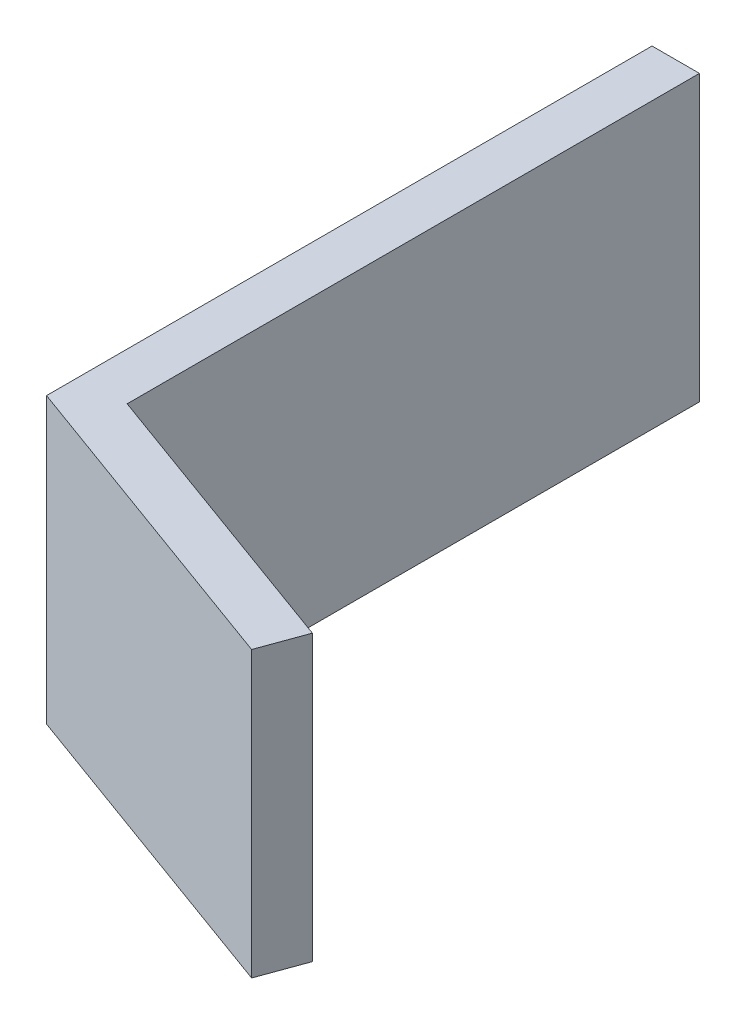
ISO-10303-21;
HEADER;
FILE_DESCRIPTION(('STEP AP214'),'2;1');
FILE_NAME('part.step','',(''),(''),'','','');
FILE_SCHEMA(('AUTOMOTIVE_DESIGN { 1 0 10303 214 1 1 1 1 }'));
ENDSEC;
DATA;
#1=APPLICATION_CONTEXT('core data for automotive mechanical design processes');
#2=APPLICATION_PROTOCOL_DEFINITION('international standard','automotive_design',2000,#1);
#3=PRODUCT_CONTEXT('',#1,'mechanical');
#4=PRODUCT('Part','Part','',(#3));
#5=PRODUCT_RELATED_PRODUCT_CATEGORY('part','',(#4));
#6=PRODUCT_DEFINITION_FORMATION('','',#4);
#7=PRODUCT_DEFINITION_CONTEXT('part definition',#1,'design');
#8=PRODUCT_DEFINITION('design','',#6,#7);
#9=PRODUCT_DEFINITION_SHAPE('','',#8);
#10=(LENGTH_UNIT() NAMED_UNIT(*) SI_UNIT(.MILLI.,.METRE.));
#11=(NAMED_UNIT(*) PLANE_ANGLE_UNIT() SI_UNIT($,.RADIAN.));
#12=(NAMED_UNIT(*) SI_UNIT($,.STERADIAN.) SOLID_ANGLE_UNIT());
#13=UNCERTAINTY_MEASURE_WITH_UNIT(LENGTH_MEASURE(1.E-05),#10,'distance_accuracy_value','');
#14=(GEOMETRIC_REPRESENTATION_CONTEXT(3) GLOBAL_UNCERTAINTY_ASSIGNED_CONTEXT((#13)) GLOBAL_UNIT_ASSIGNED_CONTEXT((#10,
#11,#12)) REPRESENTATION_CONTEXT('',''));
#15=CARTESIAN_POINT('',(0.,0.,0.));
#16=DIRECTION('',(0.,0.,1.));
#17=DIRECTION('',(1.,0.,0.));
#18=AXIS2_PLACEMENT_3D('',#15,#16,#17);
#19=CARTESIAN_POINT('',(-44.796294585378,19.05,10.7358825726635));
#20=DIRECTION('',(0.,0.,1.));
#21=DIRECTION('',(1.,0.,0.));
#22=AXIS2_PLACEMENT_3D('',#19,#20,#21);
#23=PLANE('',#22);
#24=DIRECTION('',(-1.,0.,0.));
#25=VECTOR('',#24,1.);
#26=CARTESIAN_POINT('',(-44.796294585378,0.,10.7358825726635));
#27=LINE('',#26,#25);
#28=CARTESIAN_POINT('',(-44.796294585378,0.,10.7358825726635));
#29=VERTEX_POINT('',#28);
#30=CARTESIAN_POINT('',(-47.971294585378,0.,10.7358825726635));
#31=VERTEX_POINT('',#30);
#32=EDGE_CURVE('E117',#29,#31,#27,.T.);
#33=ORIENTED_EDGE('',*,*,#32,.T.);
#34=DIRECTION('',(0.,-1.,0.));
#35=VECTOR('',#34,1.);
#36=CARTESIAN_POINT('',(-47.971294585378,19.05,10.7358825726635));
#37=LINE('',#36,#35);
#38=CARTESIAN_POINT('',(-47.971294585378,19.05,10.7358825726635));
#39=VERTEX_POINT('',#38);
#40=EDGE_CURVE('E11',#39,#31,#37,.T.);
#41=ORIENTED_EDGE('',*,*,#40,.F.);
#42=DIRECTION('',(-1.,0.,0.));
#43=VECTOR('',#42,1.);
#44=CARTESIAN_POINT('',(-44.796294585378,19.05,10.7358825726635));
#45=LINE('',#44,#43);
#46=CARTESIAN_POINT('',(-44.796294585378,19.05,10.7358825726635));
#47=VERTEX_POINT('',#46);
#48=EDGE_CURVE('E127',#47,#39,#45,.T.);
#49=ORIENTED_EDGE('',*,*,#48,.F.);
#50=DIRECTION('',(0.,-1.,0.));
#51=VECTOR('',#50,1.);
#52=CARTESIAN_POINT('',(-44.796294585378,19.05,10.7358825726635));
#53=LINE('',#52,#51);
#54=EDGE_CURVE('E113',#47,#29,#53,.T.);
#55=ORIENTED_EDGE('',*,*,#54,.T.);
#56=EDGE_LOOP('',(#33,#41,#49,#55));
#57=FACE_BOUND('',#56,.T.);
#58=ADVANCED_FACE('F33',(#57),#23,.F.);
#59=CARTESIAN_POINT('',(-47.971294585378,19.05,10.7358825726635));
#60=DIRECTION('',(1.,0.,0.));
#61=DIRECTION('',(0.,0.,-1.));
#62=AXIS2_PLACEMENT_3D('',#59,#60,#61);
#63=PLANE('',#62);
#64=DIRECTION('',(0.,0.,1.));
#65=VECTOR('',#64,1.);
#66=CARTESIAN_POINT('',(-47.971294585378,0.,10.7358825726635));
#67=LINE('',#66,#65);
#68=CARTESIAN_POINT('',(-47.971294585378,0.,51.2810557039957));
#69=VERTEX_POINT('',#68);
#70=EDGE_CURVE('E120',#31,#69,#67,.T.);
#71=ORIENTED_EDGE('',*,*,#70,.T.);
#72=DIRECTION('',(0.,-1.,0.));
#73=VECTOR('',#72,1.);
#74=CARTESIAN_POINT('',(-47.971294585378,19.05,51.2810557039957));
#75=LINE('',#74,#73);
#76=CARTESIAN_POINT('',(-47.971294585378,19.05,51.2810557039957));
#77=VERTEX_POINT('',#76);
#78=EDGE_CURVE('E41',#77,#69,#75,.T.);
#79=ORIENTED_EDGE('',*,*,#78,.F.);
#80=DIRECTION('',(0.,0.,1.));
#81=VECTOR('',#80,1.);
#82=CARTESIAN_POINT('',(-47.971294585378,19.05,10.7358825726635));
#83=LINE('',#82,#81);
#84=EDGE_CURVE('E86',#39,#77,#83,.T.);
#85=ORIENTED_EDGE('',*,*,#84,.F.);
#86=ORIENTED_EDGE('',*,*,#40,.T.);
#87=EDGE_LOOP('',(#71,#79,#85,#86));
#88=FACE_BOUND('',#87,.T.);
#89=ADVANCED_FACE('F151',(#88),#63,.F.);
#90=CARTESIAN_POINT('',(-47.971294585378,19.05,51.2810557039957));
#91=DIRECTION('',(0.342020143325664,0.,-0.93969262078591));
#92=DIRECTION('',(-0.93969262078591,0.,-0.342020143325664));
#93=AXIS2_PLACEMENT_3D('',#90,#91,#92);
#94=PLANE('',#93);
#95=DIRECTION('',(0.93969262078591,0.,0.342020143325664));
#96=VECTOR('',#95,1.);
#97=CARTESIAN_POINT('',(-47.971294585378,0.,51.2810557039957));
#98=LINE('',#97,#96);
#99=CARTESIAN_POINT('',(-26.381294585378,0.,59.1391730618029));
#100=VERTEX_POINT('',#99);
#101=EDGE_CURVE('E122',#69,#100,#98,.T.);
#102=ORIENTED_EDGE('',*,*,#101,.T.);
#103=DIRECTION('',(0.,-1.,0.));
#104=VECTOR('',#103,1.);
#105=CARTESIAN_POINT('',(-26.381294585378,19.05,59.1391730618029));
#106=LINE('',#105,#104);
#107=CARTESIAN_POINT('',(-26.381294585378,19.05,59.1391730618029));
#108=VERTEX_POINT('',#107);
#109=EDGE_CURVE('E108',#108,#100,#106,.T.);
#110=ORIENTED_EDGE('',*,*,#109,.F.);
#111=DIRECTION('',(0.93969262078591,0.,0.342020143325664));
#112=VECTOR('',#111,1.);
#113=CARTESIAN_POINT('',(-47.971294585378,19.05,51.2810557039957));
#114=LINE('',#113,#112);
#115=EDGE_CURVE('E99',#77,#108,#114,.T.);
#116=ORIENTED_EDGE('',*,*,#115,.F.);
#117=ORIENTED_EDGE('',*,*,#78,.T.);
#118=EDGE_LOOP('',(#102,#110,#116,#117));
#119=FACE_BOUND('',#118,.T.);
#120=ADVANCED_FACE('F133',(#119),#94,.F.);
#121=CARTESIAN_POINT('',(-26.381294585378,19.05,59.1391730618029));
#122=DIRECTION('',(-0.93969262078591,0.,-0.342020143325665));
#123=DIRECTION('',(-0.342020143325665,0.,0.93969262078591));
#124=AXIS2_PLACEMENT_3D('',#121,#122,#123);
#125=PLANE('',#124);
#126=DIRECTION('',(0.342020143325665,0.,-0.93969262078591));
#127=VECTOR('',#126,1.);
#128=CARTESIAN_POINT('',(-26.381294585378,0.,59.1391730618029));
#129=LINE('',#128,#127);
#130=CARTESIAN_POINT('',(-25.295380630319,0.,56.1556489908076));
#131=VERTEX_POINT('',#130);
#132=EDGE_CURVE('E107',#100,#131,#129,.T.);
#133=ORIENTED_EDGE('',*,*,#132,.T.);
#134=DIRECTION('',(0.,-1.,0.));
#135=VECTOR('',#134,1.);
#136=CARTESIAN_POINT('',(-25.295380630319,19.05,56.1556489908076));
#137=LINE('',#136,#135);
#138=CARTESIAN_POINT('',(-25.295380630319,19.05,56.1556489908076));
#139=VERTEX_POINT('',#138);
#140=EDGE_CURVE('E104',#139,#131,#137,.T.);
#141=ORIENTED_EDGE('',*,*,#140,.F.);
#142=DIRECTION('',(0.342020143325665,0.,-0.93969262078591));
#143=VECTOR('',#142,1.);
#144=CARTESIAN_POINT('',(-26.381294585378,19.05,59.1391730618029));
#145=LINE('',#144,#143);
#146=EDGE_CURVE('E93',#108,#139,#145,.T.);
#147=ORIENTED_EDGE('',*,*,#146,.F.);
#148=ORIENTED_EDGE('',*,*,#109,.T.);
#149=EDGE_LOOP('',(#133,#141,#147,#148));
#150=FACE_BOUND('',#149,.T.);
#151=ADVANCED_FACE('F105',(#150),#125,.F.);
#152=CARTESIAN_POINT('',(-25.295380630319,19.05,56.1556489908076));
#153=DIRECTION('',(-0.342020143325665,0.,0.93969262078591));
#154=DIRECTION('',(0.93969262078591,0.,0.342020143325665));
#155=AXIS2_PLACEMENT_3D('',#152,#153,#154);
#156=PLANE('',#155);
#157=DIRECTION('',(-0.93969262078591,0.,-0.342020143325665));
#158=VECTOR('',#157,1.);
#159=CARTESIAN_POINT('',(-25.295380630319,0.,56.1556489908076));
#160=LINE('',#159,#158);
#161=CARTESIAN_POINT('',(-44.796294585378,0.,49.0578967701798));
#162=VERTEX_POINT('',#161);
#163=EDGE_CURVE('E72',#131,#162,#160,.T.);
#164=ORIENTED_EDGE('',*,*,#163,.T.);
#165=DIRECTION('',(0.,-1.,0.));
#166=VECTOR('',#165,1.);
#167=CARTESIAN_POINT('',(-44.796294585378,19.05,49.0578967701798));
#168=LINE('',#167,#166);
#169=CARTESIAN_POINT('',(-44.796294585378,19.05,49.0578967701798));
#170=VERTEX_POINT('',#169);
#171=EDGE_CURVE('E109',#170,#162,#168,.T.);
#172=ORIENTED_EDGE('',*,*,#171,.F.);
#173=DIRECTION('',(-0.93969262078591,0.,-0.342020143325665));
#174=VECTOR('',#173,1.);
#175=CARTESIAN_POINT('',(-25.295380630319,19.05,56.1556489908076));
#176=LINE('',#175,#174);
#177=EDGE_CURVE('E97',#139,#170,#176,.T.);
#178=ORIENTED_EDGE('',*,*,#177,.F.);
#179=ORIENTED_EDGE('',*,*,#140,.T.);
#180=EDGE_LOOP('',(#164,#172,#178,#179));
#181=FACE_BOUND('',#180,.T.);
#182=ADVANCED_FACE('F111',(#181),#156,.F.);
#183=CARTESIAN_POINT('',(-44.796294585378,19.05,49.0578967701798));
#184=DIRECTION('',(-1.,0.,0.));
#185=DIRECTION('',(0.,0.,1.));
#186=AXIS2_PLACEMENT_3D('',#183,#184,#185);
#187=PLANE('',#186);
#188=DIRECTION('',(0.,0.,-1.));
#189=VECTOR('',#188,1.);
#190=CARTESIAN_POINT('',(-44.796294585378,0.,49.0578967701798));
#191=LINE('',#190,#189);
#192=EDGE_CURVE('E78',#162,#29,#191,.T.);
#193=ORIENTED_EDGE('',*,*,#192,.T.);
#194=ORIENTED_EDGE('',*,*,#54,.F.);
#195=DIRECTION('',(0.,0.,-1.));
#196=VECTOR('',#195,1.);
#197=CARTESIAN_POINT('',(-44.796294585378,19.05,49.0578967701798));
#198=LINE('',#197,#196);
#199=EDGE_CURVE('E49',#170,#47,#198,.T.);
#200=ORIENTED_EDGE('',*,*,#199,.F.);
#201=ORIENTED_EDGE('',*,*,#171,.T.);
#202=EDGE_LOOP('',(#193,#194,#200,#201));
#203=FACE_BOUND('',#202,.T.);
#204=ADVANCED_FACE('F140',(#203),#187,.F.);
#205=CARTESIAN_POINT('',(0.,19.05,0.));
#206=DIRECTION('',(0.,1.,0.));
#207=DIRECTION('',(0.,0.,1.));
#208=AXIS2_PLACEMENT_3D('',#205,#206,#207);
#209=PLANE('',#208);
#210=ORIENTED_EDGE('',*,*,#48,.T.);
#211=ORIENTED_EDGE('',*,*,#84,.T.);
#212=ORIENTED_EDGE('',*,*,#115,.T.);
#213=ORIENTED_EDGE('',*,*,#146,.T.);
#214=ORIENTED_EDGE('',*,*,#177,.T.);
#215=ORIENTED_EDGE('',*,*,#199,.T.);
#216=EDGE_LOOP('',(#210,#211,#212,#213,#214,#215));
#217=FACE_BOUND('',#216,.T.);
#218=ADVANCED_FACE('F95',(#217),#209,.T.);
#219=CARTESIAN_POINT('',(0.,0.,0.));
#220=DIRECTION('',(0.,1.,0.));
#221=DIRECTION('',(0.,0.,1.));
#222=AXIS2_PLACEMENT_3D('',#219,#220,#221);
#223=PLANE('',#222);
#224=ORIENTED_EDGE('',*,*,#32,.F.);
#225=ORIENTED_EDGE('',*,*,#192,.F.);
#226=ORIENTED_EDGE('',*,*,#163,.F.);
#227=ORIENTED_EDGE('',*,*,#132,.F.);
#228=ORIENTED_EDGE('',*,*,#101,.F.);
#229=ORIENTED_EDGE('',*,*,#70,.F.);
#230=EDGE_LOOP('',(#224,#225,#226,#227,#228,#229));
#231=FACE_BOUND('',#230,.T.);
#232=ADVANCED_FACE('F136',(#231),#223,.F.);
#233=CLOSED_SHELL('',(#58,#89,#120,#151,#182,#204,#218,#232));
#234=MANIFOLD_SOLID_BREP('B2',#233);
#235=ADVANCED_BREP_SHAPE_REPRESENTATION('',(#18,#234),#14);
#236=SHAPE_DEFINITION_REPRESENTATION(#9,#235);
ENDSEC;
END-ISO-10303-21;
